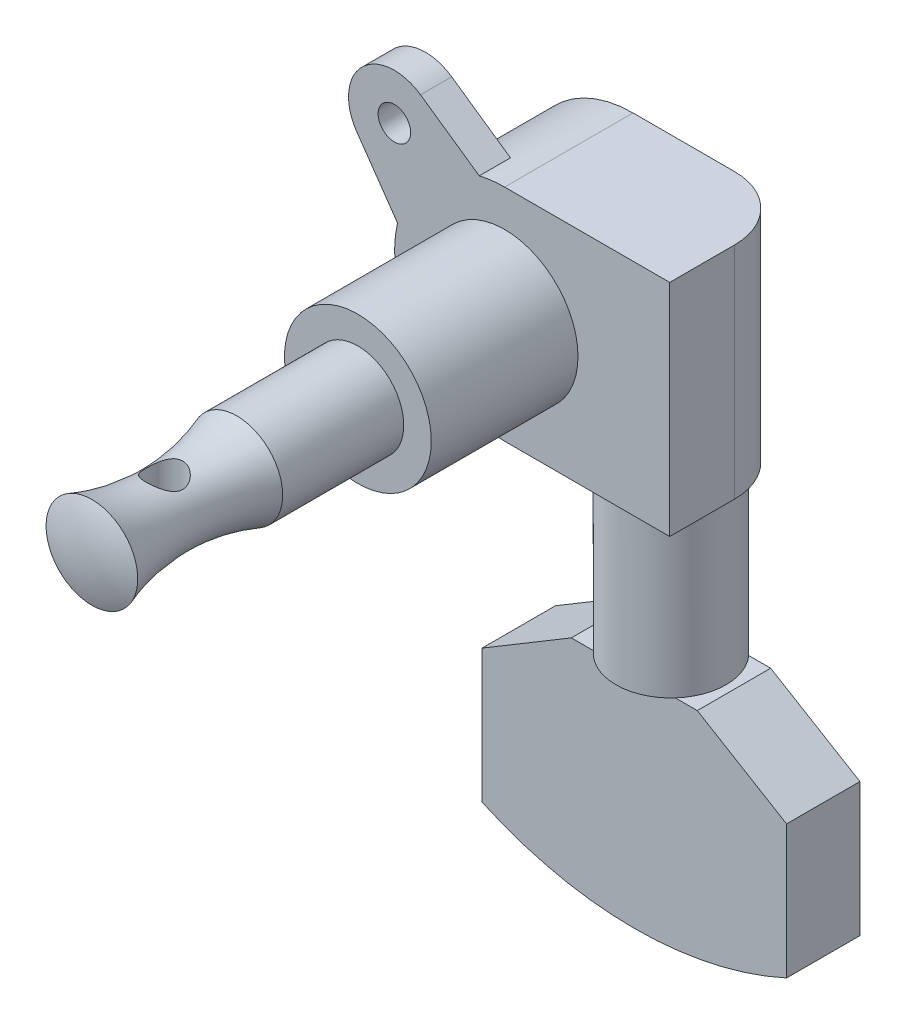
ISO-10303-21;
HEADER;
FILE_DESCRIPTION(('STEP AP214'),'2;1');
FILE_NAME('part.step','',(''),(''),'','','');
FILE_SCHEMA(('AUTOMOTIVE_DESIGN { 1 0 10303 214 1 1 1 1 }'));
ENDSEC;
DATA;
#1=APPLICATION_CONTEXT('core data for automotive mechanical design processes');
#2=APPLICATION_PROTOCOL_DEFINITION('international standard','automotive_design',2000,#1);
#3=PRODUCT_CONTEXT('',#1,'mechanical');
#4=PRODUCT('Part','Part','',(#3));
#5=PRODUCT_RELATED_PRODUCT_CATEGORY('part','',(#4));
#6=PRODUCT_DEFINITION_FORMATION('','',#4);
#7=PRODUCT_DEFINITION_CONTEXT('part definition',#1,'design');
#8=PRODUCT_DEFINITION('design','',#6,#7);
#9=PRODUCT_DEFINITION_SHAPE('','',#8);
#10=(LENGTH_UNIT() NAMED_UNIT(*) SI_UNIT(.MILLI.,.METRE.));
#11=(NAMED_UNIT(*) PLANE_ANGLE_UNIT() SI_UNIT($,.RADIAN.));
#12=(NAMED_UNIT(*) SI_UNIT($,.STERADIAN.) SOLID_ANGLE_UNIT());
#13=UNCERTAINTY_MEASURE_WITH_UNIT(LENGTH_MEASURE(1.E-05),#10,'distance_accuracy_value','');
#14=(GEOMETRIC_REPRESENTATION_CONTEXT(3) GLOBAL_UNCERTAINTY_ASSIGNED_CONTEXT((#13)) GLOBAL_UNIT_ASSIGNED_CONTEXT((#10,
#11,#12)) REPRESENTATION_CONTEXT('',''));
#15=CARTESIAN_POINT('',(0.,0.,0.));
#16=DIRECTION('',(0.,0.,1.));
#17=DIRECTION('',(1.,0.,0.));
#18=AXIS2_PLACEMENT_3D('',#15,#16,#17);
#19=CARTESIAN_POINT('',(7.03,-8.94661103641939,6.94));
#20=DIRECTION('',(0.,0.,-1.));
#21=DIRECTION('',(-1.,0.,0.));
#22=AXIS2_PLACEMENT_3D('',#19,#20,#21);
#23=CYLINDRICAL_SURFACE('',#22,25.3433889635806);
#24=CARTESIAN_POINT('',(7.03,-8.94661103641939,6.94));
#25=DIRECTION('',(0.,0.,-1.));
#26=DIRECTION('',(-1.,0.,0.));
#27=AXIS2_PLACEMENT_3D('',#24,#25,#26);
#28=CIRCLE('',#27,25.3433889635806);
#29=CARTESIAN_POINT('',(-3.511,-31.9938382700659,6.94));
#30=VERTEX_POINT('',#29);
#31=CARTESIAN_POINT('',(17.571,-31.9938382700659,6.94));
#32=VERTEX_POINT('',#31);
#33=EDGE_CURVE('E139',#30,#32,#28,.F.);
#34=ORIENTED_EDGE('',*,*,#33,.F.);
#35=DIRECTION('',(0.,0.,1.));
#36=VECTOR('',#35,1.);
#37=CARTESIAN_POINT('',(-3.511,-31.9938382700659,6.94));
#38=LINE('',#37,#36);
#39=CARTESIAN_POINT('',(-3.511,-31.9938382700659,1.86));
#40=VERTEX_POINT('',#39);
#41=EDGE_CURVE('E136',#40,#30,#38,.T.);
#42=ORIENTED_EDGE('',*,*,#41,.F.);
#43=CARTESIAN_POINT('',(7.03,-8.94661103641939,1.86));
#44=DIRECTION('',(0.,0.,-1.));
#45=DIRECTION('',(-1.,0.,0.));
#46=AXIS2_PLACEMENT_3D('',#43,#44,#45);
#47=CIRCLE('',#46,25.3433889635806);
#48=CARTESIAN_POINT('',(17.571,-31.9938382700659,1.86));
#49=VERTEX_POINT('',#48);
#50=EDGE_CURVE('E19',#49,#40,#47,.T.);
#51=ORIENTED_EDGE('',*,*,#50,.F.);
#52=DIRECTION('',(0.,0.,-1.));
#53=VECTOR('',#52,1.);
#54=CARTESIAN_POINT('',(17.571,-31.9938382700659,1.86));
#55=LINE('',#54,#53);
#56=EDGE_CURVE('E145',#32,#49,#55,.T.);
#57=ORIENTED_EDGE('',*,*,#56,.F.);
#58=EDGE_LOOP('',(#34,#42,#51,#57));
#59=FACE_BOUND('',#58,.T.);
#60=ADVANCED_FACE('F16',(#59),#23,.T.);
#61=CARTESIAN_POINT('',(17.571,-19.05,1.86));
#62=DIRECTION('',(1.,0.,0.));
#63=DIRECTION('',(0.,0.,-1.));
#64=AXIS2_PLACEMENT_3D('',#61,#62,#63);
#65=PLANE('',#64);
#66=DIRECTION('',(0.,0.,1.));
#67=VECTOR('',#66,1.);
#68=CARTESIAN_POINT('',(17.571,-22.7538524438819,6.94));
#69=LINE('',#68,#67);
#70=CARTESIAN_POINT('',(17.571,-22.7538524438819,6.94));
#71=VERTEX_POINT('',#70);
#72=CARTESIAN_POINT('',(17.571,-22.7538524438819,1.86));
#73=VERTEX_POINT('',#72);
#74=EDGE_CURVE('E144',#71,#73,#69,.F.);
#75=ORIENTED_EDGE('',*,*,#74,.F.);
#76=DIRECTION('',(0.,1.,0.));
#77=VECTOR('',#76,1.);
#78=CARTESIAN_POINT('',(17.571,-19.05,6.94));
#79=LINE('',#78,#77);
#80=EDGE_CURVE('E450',#32,#71,#79,.T.);
#81=ORIENTED_EDGE('',*,*,#80,.F.);
#82=ORIENTED_EDGE('',*,*,#56,.T.);
#83=DIRECTION('',(0.,1.,0.));
#84=VECTOR('',#83,1.);
#85=CARTESIAN_POINT('',(17.571,-19.05,1.86));
#86=LINE('',#85,#84);
#87=EDGE_CURVE('E161',#73,#49,#86,.F.);
#88=ORIENTED_EDGE('',*,*,#87,.F.);
#89=EDGE_LOOP('',(#75,#81,#82,#88));
#90=FACE_BOUND('',#89,.T.);
#91=ADVANCED_FACE('F338',(#90),#65,.T.);
#92=CARTESIAN_POINT('',(-3.511,-19.05,6.94));
#93=DIRECTION('',(-1.,0.,0.));
#94=DIRECTION('',(0.,0.,1.));
#95=AXIS2_PLACEMENT_3D('',#92,#93,#94);
#96=PLANE('',#95);
#97=DIRECTION('',(0.,0.,1.));
#98=VECTOR('',#97,1.);
#99=CARTESIAN_POINT('',(-3.511,-22.7538524438819,6.94));
#100=LINE('',#99,#98);
#101=CARTESIAN_POINT('',(-3.511,-22.7538524438819,1.86));
#102=VERTEX_POINT('',#101);
#103=CARTESIAN_POINT('',(-3.511,-22.7538524438819,6.94));
#104=VERTEX_POINT('',#103);
#105=EDGE_CURVE('E150',#102,#104,#100,.T.);
#106=ORIENTED_EDGE('',*,*,#105,.F.);
#107=DIRECTION('',(0.,1.,0.));
#108=VECTOR('',#107,1.);
#109=CARTESIAN_POINT('',(-3.511,-19.05,1.86));
#110=LINE('',#109,#108);
#111=EDGE_CURVE('E148',#40,#102,#110,.T.);
#112=ORIENTED_EDGE('',*,*,#111,.F.);
#113=ORIENTED_EDGE('',*,*,#41,.T.);
#114=DIRECTION('',(0.,1.,0.));
#115=VECTOR('',#114,1.);
#116=CARTESIAN_POINT('',(-3.511,-19.05,6.94));
#117=LINE('',#116,#115);
#118=EDGE_CURVE('E318',#104,#30,#117,.F.);
#119=ORIENTED_EDGE('',*,*,#118,.F.);
#120=EDGE_LOOP('',(#106,#112,#113,#119));
#121=FACE_BOUND('',#120,.T.);
#122=ADVANCED_FACE('F149',(#121),#96,.T.);
#123=CARTESIAN_POINT('',(11.3893157644832,-19.05,6.94));
#124=DIRECTION('',(0.513969357533937,0.857808544790824,0.));
#125=DIRECTION('',(-0.857808544790824,0.513969357533937,0.));
#126=AXIS2_PLACEMENT_3D('',#123,#124,#125);
#127=PLANE('',#126);
#128=DIRECTION('',(-0.857808544790822,0.513969357533941,0.));
#129=VECTOR('',#128,1.);
#130=CARTESIAN_POINT('',(17.571,-22.7538524438819,6.94));
#131=LINE('',#130,#129);
#132=CARTESIAN_POINT('',(11.3893157644832,-19.05,6.94));
#133=VERTEX_POINT('',#132);
#134=EDGE_CURVE('E427',#71,#133,#131,.T.);
#135=ORIENTED_EDGE('',*,*,#134,.F.);
#136=ORIENTED_EDGE('',*,*,#74,.T.);
#137=DIRECTION('',(0.857808544790822,-0.513969357533941,0.));
#138=VECTOR('',#137,1.);
#139=CARTESIAN_POINT('',(11.3893157644832,-19.05,1.86));
#140=LINE('',#139,#138);
#141=CARTESIAN_POINT('',(11.3893157644832,-19.05,1.86));
#142=VERTEX_POINT('',#141);
#143=EDGE_CURVE('E437',#142,#73,#140,.T.);
#144=ORIENTED_EDGE('',*,*,#143,.F.);
#145=DIRECTION('',(0.,0.,1.));
#146=VECTOR('',#145,1.);
#147=CARTESIAN_POINT('',(11.3893157644832,-19.05,4.4));
#148=LINE('',#147,#146);
#149=EDGE_CURVE('E313',#133,#142,#148,.F.);
#150=ORIENTED_EDGE('',*,*,#149,.F.);
#151=EDGE_LOOP('',(#135,#136,#144,#150));
#152=FACE_BOUND('',#151,.T.);
#153=ADVANCED_FACE('F334',(#152),#127,.T.);
#154=CARTESIAN_POINT('',(-3.511,-19.05,1.86));
#155=DIRECTION('',(0.,0.,-1.));
#156=DIRECTION('',(-1.,0.,0.));
#157=AXIS2_PLACEMENT_3D('',#154,#155,#156);
#158=PLANE('',#157);
#159=ORIENTED_EDGE('',*,*,#143,.T.);
#160=ORIENTED_EDGE('',*,*,#87,.T.);
#161=ORIENTED_EDGE('',*,*,#50,.T.);
#162=ORIENTED_EDGE('',*,*,#111,.T.);
#163=DIRECTION('',(-0.857808544790824,-0.513969357533937,0.));
#164=VECTOR('',#163,1.);
#165=CARTESIAN_POINT('',(-3.511,-22.7538524438819,1.86));
#166=LINE('',#165,#164);
#167=CARTESIAN_POINT('',(2.67068423551685,-19.05,1.86));
#168=VERTEX_POINT('',#167);
#169=EDGE_CURVE('E435',#168,#102,#166,.T.);
#170=ORIENTED_EDGE('',*,*,#169,.F.);
#171=DIRECTION('',(-1.,0.,0.));
#172=VECTOR('',#171,1.);
#173=CARTESIAN_POINT('',(-3.511,-19.05,1.86));
#174=LINE('',#173,#172);
#175=CARTESIAN_POINT('',(4.19019366857527,-19.05,1.86));
#176=VERTEX_POINT('',#175);
#177=EDGE_CURVE('E155',#168,#176,#174,.F.);
#178=ORIENTED_EDGE('',*,*,#177,.T.);
#179=DIRECTION('',(1.,0.,0.));
#180=VECTOR('',#179,1.);
#181=CARTESIAN_POINT('',(7.03,-19.05,1.86));
#182=LINE('',#181,#180);
#183=CARTESIAN_POINT('',(9.86980633142473,-19.05,1.86));
#184=VERTEX_POINT('',#183);
#185=EDGE_CURVE('E301',#176,#184,#182,.T.);
#186=ORIENTED_EDGE('',*,*,#185,.T.);
#187=DIRECTION('',(1.,0.,0.));
#188=VECTOR('',#187,1.);
#189=CARTESIAN_POINT('',(7.03,-19.05,1.86));
#190=LINE('',#189,#188);
#191=EDGE_CURVE('E307',#142,#184,#190,.F.);
#192=ORIENTED_EDGE('',*,*,#191,.F.);
#193=EDGE_LOOP('',(#159,#160,#161,#162,#170,#178,#186,#192));
#194=FACE_BOUND('',#193,.T.);
#195=ADVANCED_FACE('F159',(#194),#158,.T.);
#196=CARTESIAN_POINT('',(-3.511,-22.7538524438819,6.94));
#197=DIRECTION('',(-0.513969357533937,0.857808544790824,0.));
#198=DIRECTION('',(-0.857808544790824,-0.513969357533937,0.));
#199=AXIS2_PLACEMENT_3D('',#196,#197,#198);
#200=PLANE('',#199);
#201=DIRECTION('',(-0.857808544790823,-0.513969357533939,0.));
#202=VECTOR('',#201,1.);
#203=CARTESIAN_POINT('',(2.67068423551684,-19.05,6.94));
#204=LINE('',#203,#202);
#205=CARTESIAN_POINT('',(2.67068423551685,-19.05,6.94));
#206=VERTEX_POINT('',#205);
#207=EDGE_CURVE('E449',#206,#104,#204,.T.);
#208=ORIENTED_EDGE('',*,*,#207,.F.);
#209=DIRECTION('',(0.,0.,1.));
#210=VECTOR('',#209,1.);
#211=CARTESIAN_POINT('',(2.67068423551685,-19.05,4.4));
#212=LINE('',#211,#210);
#213=EDGE_CURVE('E298',#168,#206,#212,.T.);
#214=ORIENTED_EDGE('',*,*,#213,.F.);
#215=ORIENTED_EDGE('',*,*,#169,.T.);
#216=ORIENTED_EDGE('',*,*,#105,.T.);
#217=EDGE_LOOP('',(#208,#214,#215,#216));
#218=FACE_BOUND('',#217,.T.);
#219=ADVANCED_FACE('F327',(#218),#200,.T.);
#220=CARTESIAN_POINT('',(17.571,-19.05,6.94));
#221=DIRECTION('',(0.,0.,1.));
#222=DIRECTION('',(1.,0.,0.));
#223=AXIS2_PLACEMENT_3D('',#220,#221,#222);
#224=PLANE('',#223);
#225=ORIENTED_EDGE('',*,*,#207,.T.);
#226=ORIENTED_EDGE('',*,*,#118,.T.);
#227=ORIENTED_EDGE('',*,*,#33,.T.);
#228=ORIENTED_EDGE('',*,*,#80,.T.);
#229=ORIENTED_EDGE('',*,*,#134,.T.);
#230=DIRECTION('',(1.,0.,0.));
#231=VECTOR('',#230,1.);
#232=CARTESIAN_POINT('',(7.03,-19.05,6.94));
#233=LINE('',#232,#231);
#234=CARTESIAN_POINT('',(9.86980633142473,-19.05,6.94));
#235=VERTEX_POINT('',#234);
#236=EDGE_CURVE('E304',#235,#133,#233,.T.);
#237=ORIENTED_EDGE('',*,*,#236,.F.);
#238=DIRECTION('',(1.,0.,0.));
#239=VECTOR('',#238,1.);
#240=CARTESIAN_POINT('',(7.03,-19.05,6.94));
#241=LINE('',#240,#239);
#242=CARTESIAN_POINT('',(4.19019366857527,-19.05,6.94));
#243=VERTEX_POINT('',#242);
#244=EDGE_CURVE('E290',#235,#243,#241,.F.);
#245=ORIENTED_EDGE('',*,*,#244,.T.);
#246=DIRECTION('',(1.,0.,0.));
#247=VECTOR('',#246,1.);
#248=CARTESIAN_POINT('',(7.03,-19.05,6.94));
#249=LINE('',#248,#247);
#250=EDGE_CURVE('E294',#206,#243,#249,.T.);
#251=ORIENTED_EDGE('',*,*,#250,.F.);
#252=EDGE_LOOP('',(#225,#226,#227,#228,#229,#237,#245,#251));
#253=FACE_BOUND('',#252,.T.);
#254=ADVANCED_FACE('F323',(#253),#224,.T.);
#255=CARTESIAN_POINT('',(0.,0.,29.845));
#256=DIRECTION('',(1.,0.,0.));
#257=DIRECTION('',(0.,1.,0.));
#258=AXIS2_PLACEMENT_3D('',#255,#256,#257);
#259=SPHERICAL_SURFACE('',#258,8.25499999999996);
#260=CARTESIAN_POINT('',(0.,0.,37.465));
#261=DIRECTION('',(0.,0.,-1.));
#262=DIRECTION('',(-1.,0.,0.));
#263=AXIS2_PLACEMENT_3D('',#260,#261,#262);
#264=CIRCLE('',#263,3.175);
#265=CARTESIAN_POINT('',(-3.175,0.,37.465));
#266=VERTEX_POINT('',#265);
#267=EDGE_CURVE('E293',#266,#266,#264,.F.);
#268=ORIENTED_EDGE('',*,*,#267,.T.);
#269=EDGE_LOOP('',(#268));
#270=FACE_BOUND('',#269,.T.);
#271=ADVANCED_FACE('F320',(#270),#259,.T.);
#272=CARTESIAN_POINT('',(0.,0.,32.4485));
#273=DIRECTION('',(0.,1.,0.));
#274=DIRECTION('',(0.,0.,1.));
#275=AXIS2_PLACEMENT_3D('',#272,#273,#274);
#276=CYLINDRICAL_SURFACE('',#275,1.27);
#277=CARTESIAN_POINT('',(0.,-2.34134804982679,31.1785));
#278=CARTESIAN_POINT('',(0.0645155415284043,-2.3413432961982,31.1785050060415));
#279=CARTESIAN_POINT('',(0.129120718154893,-2.33821776241501,31.183450840019));
#280=CARTESIAN_POINT('',(0.25635007826998,-2.326022860233,31.2029690807942));
#281=CARTESIAN_POINT('',(0.318969728246022,-2.31694079075164,31.2175620586653));
#282=CARTESIAN_POINT('',(0.440120293002742,-2.29378258410033,31.2555191221188));
#283=CARTESIAN_POINT('',(0.498670535223999,-2.27973230578129,31.2788378274002));
#284=CARTESIAN_POINT('',(0.610832517780306,-2.24784751368233,31.3332982873781));
#285=CARTESIAN_POINT('',(0.664444949383017,-2.23001353075961,31.3644389447602));
#286=CARTESIAN_POINT('',(0.770183759520476,-2.19034853035571,31.4365013773126));
#287=CARTESIAN_POINT('',(0.821826235178395,-2.16830950989919,31.4780165209102));
#288=CARTESIAN_POINT('',(0.917886385020524,-2.12318299543908,31.568307922975));
#289=CARTESIAN_POINT('',(0.962294347095998,-2.10009414436777,31.6170937767228));
#290=CARTESIAN_POINT('',(1.04862298745138,-2.05182788275068,31.7281687326515));
#291=CARTESIAN_POINT('',(1.08942672047412,-2.02678128371553,31.7913908160459));
#292=CARTESIAN_POINT('',(1.15967965765399,-1.98115067695329,31.9253038963243));
#293=CARTESIAN_POINT('',(1.1891481291054,-1.96055912300006,31.9959819568061));
#294=CARTESIAN_POINT('',(1.22935594940783,-1.93155320825814,32.1246053914684));
#295=CARTESIAN_POINT('',(1.24294539262395,-1.92137704348119,32.1812608524178));
#296=CARTESIAN_POINT('',(1.26223319098596,-1.90677986492481,32.2965968233442));
#297=CARTESIAN_POINT('',(1.26794170353594,-1.90235144355943,32.3552746265855));
#298=CARTESIAN_POINT('',(1.27113181491214,-1.89988823379398,32.4731273770166));
#299=CARTESIAN_POINT('',(1.26859456671673,-1.90186809251409,32.5323031543294));
#300=CARTESIAN_POINT('',(1.25541872710925,-1.91195158446425,32.6492261052392));
#301=CARTESIAN_POINT('',(1.24477417326541,-1.92005972464022,32.7069721951007));
#302=CARTESIAN_POINT('',(1.21624965653477,-1.9410862048996,32.8184883981703));
#303=CARTESIAN_POINT('',(1.19850936876097,-1.95391132303948,32.8723128232904));
#304=CARTESIAN_POINT('',(1.15648150650644,-1.98300311405889,32.9763268038985));
#305=CARTESIAN_POINT('',(1.13219163544481,-1.9992709936954,33.0265150765402));
#306=CARTESIAN_POINT('',(1.07282579922777,-2.03692547544775,33.1312759277066));
#307=CARTESIAN_POINT('',(1.03660218576776,-2.05870858387203,33.1850553073578));
#308=CARTESIAN_POINT('',(0.956603541671164,-2.10308888591938,33.2863432882935));
#309=CARTESIAN_POINT('',(0.912820786780159,-2.12568689336888,33.3338453866594));
#310=CARTESIAN_POINT('',(0.810797951449898,-2.17333397788741,33.4288558551749));
#311=CARTESIAN_POINT('',(0.751366940584441,-2.19820861330459,33.4751871420684));
#312=CARTESIAN_POINT('',(0.624111194516701,-2.24390052515201,33.5571488755366));
#313=CARTESIAN_POINT('',(0.55629006378426,-2.26471953408618,33.5927838949333));
#314=CARTESIAN_POINT('',(0.417764775652685,-2.29887962312592,33.650028490796));
#315=CARTESIAN_POINT('',(0.347425169497777,-2.31256942568483,33.6723024769138));
#316=CARTESIAN_POINT('',(0.202962740942721,-2.33242543939802,33.7043493538945));
#317=CARTESIAN_POINT('',(0.128845527349749,-2.33860248452482,33.7141402473216));
#318=CARTESIAN_POINT('',(-0.00899437461165927,-2.34232730514032,33.7200543204683));
#319=CARTESIAN_POINT('',(-0.0726152720470022,-2.3410266563161,33.7180012951376));
#320=CARTESIAN_POINT('',(-0.198445401587482,-2.33255245229131,33.7044939258685));
#321=CARTESIAN_POINT('',(-0.260654665699185,-2.32537903038366,33.6930397953046));
#322=CARTESIAN_POINT('',(-0.379765209659764,-2.30620135250195,33.6618997524301));
#323=CARTESIAN_POINT('',(-0.436776187711693,-2.2943756692098,33.6425171797588));
#324=CARTESIAN_POINT('',(-0.546702043090119,-2.26687564454281,33.5963561239407));
#325=CARTESIAN_POINT('',(-0.599616168872457,-2.2512005992143,33.5695762879044));
#326=CARTESIAN_POINT('',(-0.70601457603287,-2.21529226422759,33.5061776527428));
#327=CARTESIAN_POINT('',(-0.75894661770017,-2.19474988424211,33.4688098698055));
#328=CARTESIAN_POINT('',(-0.858190516112198,-2.15195297967678,33.3868803824016));
#329=CARTESIAN_POINT('',(-0.904494547575605,-2.12969647823013,33.3423103046061));
#330=CARTESIAN_POINT('',(-0.996041306155078,-2.08202527387771,33.2398155192849));
#331=CARTESIAN_POINT('',(-1.04017542644016,-2.05661631229116,33.1808921122809));
#332=CARTESIAN_POINT('',(-1.11802136480856,-2.00876935926069,33.0554310858823));
#333=CARTESIAN_POINT('',(-1.15174246009807,-1.98632873350795,32.9889003169123));
#334=CARTESIAN_POINT('',(-1.20145846810688,-1.95183110936972,32.8642921525223));
#335=CARTESIAN_POINT('',(-1.21970148746193,-1.9385799447173,32.8074464929718));
#336=CARTESIAN_POINT('',(-1.24810624675337,-1.91755363772971,32.6908230098901));
#337=CARTESIAN_POINT('',(-1.25827962516736,-1.90977061080659,32.6310495416919));
#338=CARTESIAN_POINT('',(-1.26998255259826,-1.90079253479882,32.5098570220464));
#339=CARTESIAN_POINT('',(-1.27147070246057,-1.89962903914301,32.4484314889879));
#340=CARTESIAN_POINT('',(-1.2655824650228,-1.90417013375876,32.3262524162664));
#341=CARTESIAN_POINT('',(-1.25820255885927,-1.90987745038486,32.2654991530177));
#342=CARTESIAN_POINT('',(-1.23584197119719,-1.92668000444917,32.1505049469001));
#343=CARTESIAN_POINT('',(-1.2213981233268,-1.93739260392981,32.0960993730753));
#344=CARTESIAN_POINT('',(-1.18585262286941,-1.96277621293754,31.990503287669));
#345=CARTESIAN_POINT('',(-1.16474844365195,-1.9774487243709,31.939314005055));
#346=CARTESIAN_POINT('',(-1.11303754413028,-2.01169397103082,31.8336961666146));
#347=CARTESIAN_POINT('',(-1.08150260993314,-2.03166758409672,31.7798541649505));
#348=CARTESIAN_POINT('',(-1.01125365151988,-2.07314336463508,31.6777114881983));
#349=CARTESIAN_POINT('',(-0.97253369085038,-2.0946467869499,31.6294154491341));
#350=CARTESIAN_POINT('',(-0.880625008861319,-2.14146861788311,31.5304797984215));
#351=CARTESIAN_POINT('',(-0.826084692710484,-2.16675463591504,31.4810678281839));
#352=CARTESIAN_POINT('',(-0.708464277135598,-2.2145215466491,31.3918868501254));
#353=CARTESIAN_POINT('',(-0.645379307892076,-2.23700082557413,31.3521233775734));
#354=CARTESIAN_POINT('',(-0.51218781392149,-2.27659730993986,31.2839832374478));
#355=CARTESIAN_POINT('',(-0.442128292577023,-2.29374757553794,31.2555360440539));
#356=CARTESIAN_POINT('',(-0.333320883848156,-2.31398343741828,31.2224337016774));
#357=CARTESIAN_POINT('',(-0.296471855284281,-2.31981062078107,31.2129991308918));
#358=CARTESIAN_POINT('',(-0.221834206952216,-2.32946631855459,31.1974452528892));
#359=CARTESIAN_POINT('',(-0.184046357383799,-2.33329641809516,31.1913233162146));
#360=CARTESIAN_POINT('',(-0.121807293858874,-2.33781280518529,31.1841201063924));
#361=CARTESIAN_POINT('',(-0.0975146239754468,-2.3391361255162,31.1820149041601));
#362=CARTESIAN_POINT('',(-0.0488189202557583,-2.34090467698216,31.17920385646));
#363=CARTESIAN_POINT('',(-0.0244158790800449,-2.34134984883549,31.1784981054658));
#364=CARTESIAN_POINT('',(0.,-2.34134804982679,31.1785));
#365=B_SPLINE_CURVE_WITH_KNOTS('',3,(#277,#278,#279,#280,#281,#282,#283,#284,#285,#286,#287,
#288,#289,#290,#291,#292,#293,#294,#295,#296,#297,#298,#299,#300,#301,#302,#303,#304,#305,#306,
#307,#308,#309,#310,#311,#312,#313,#314,#315,#316,#317,#318,#319,#320,#321,#322,#323,#324,#325,
#326,#327,#328,#329,#330,#331,#332,#333,#334,#335,#336,#337,#338,#339,#340,#341,#342,#343,#344,
#345,#346,#347,#348,#349,#350,#351,#352,#353,#354,#355,#356,#357,#358,#359,#360,#361,#362,#363,
#364),.UNSPECIFIED.,.T.,.F.,(4,2,2,2,2,2,2,2,2,2,2,2,2,2,2,2,2,2,2,2,2,2,2,2,2,2,2,2,2,2,2,2,2,
2,2,2,2,2,2,2,2,2,2,4),(0.,0.193447265691743,0.387308364686307,0.580174945887285,
0.773014485604155,0.98169604742324,1.19065548940586,1.42741536315655,1.66377100316121,
1.84045973034577,2.01692051749689,2.19378491777056,2.3707795168368,2.54444923192882,
2.71817992286712,2.9226203105629,3.1272708541758,3.3641500562336,3.60092784400602,
3.82466395799369,4.04807704332116,4.23810441872177,4.42812748123644,4.61147458334121,
4.794855240125,4.99798394723869,5.20135053198918,5.43393995378666,5.66632155438781,
5.84904419239942,6.03150281621052,6.2148304445271,6.39823084166319,6.5694619072887,
6.74075800852695,6.93659448249347,7.13259348790329,7.36495654204574,7.59745258756717,
7.828476065292,7.94375097376357,8.05893424615956,8.13213933933659,8.20534937424601),.UNSPECIFIED.);
#366=CARTESIAN_POINT('',(0.,-2.34134804982679,31.1785));
#367=VERTEX_POINT('',#366);
#368=EDGE_CURVE('E257',#367,#367,#365,.T.);
#369=ORIENTED_EDGE('',*,*,#368,.T.);
#370=EDGE_LOOP('',(#369));
#371=FACE_BOUND('',#370,.T.);
#372=CARTESIAN_POINT('',(0.,2.34134804982679,31.1785));
#373=CARTESIAN_POINT('',(-0.0645155415284059,2.3413432961982,31.1785050060415));
#374=CARTESIAN_POINT('',(-0.129120718154894,2.33821776241501,31.183450840019));
#375=CARTESIAN_POINT('',(-0.256350078269981,2.326022860233,31.2029690807942));
#376=CARTESIAN_POINT('',(-0.318969728246023,2.31694079075164,31.2175620586653));
#377=CARTESIAN_POINT('',(-0.440120293002743,2.29378258410033,31.2555191221188));
#378=CARTESIAN_POINT('',(-0.498670535224,2.27973230578129,31.2788378274002));
#379=CARTESIAN_POINT('',(-0.610832517780307,2.24784751368233,31.3332982873781));
#380=CARTESIAN_POINT('',(-0.664444949383019,2.23001353075961,31.3644389447602));
#381=CARTESIAN_POINT('',(-0.770183759520477,2.19034853035571,31.4365013773126));
#382=CARTESIAN_POINT('',(-0.821826235178395,2.16830950989919,31.4780165209102));
#383=CARTESIAN_POINT('',(-0.917886385020525,2.12318299543908,31.568307922975));
#384=CARTESIAN_POINT('',(-0.962294347096,2.10009414436776,31.6170937767228));
#385=CARTESIAN_POINT('',(-1.04862298745138,2.05182788275068,31.7281687326515));
#386=CARTESIAN_POINT('',(-1.08942672047412,2.02678128371552,31.7913908160459));
#387=CARTESIAN_POINT('',(-1.15967965765399,1.98115067695329,31.9253038963243));
#388=CARTESIAN_POINT('',(-1.1891481291054,1.96055912300006,31.9959819568061));
#389=CARTESIAN_POINT('',(-1.22935594940783,1.93155320825814,32.1246053914684));
#390=CARTESIAN_POINT('',(-1.24294539262395,1.92137704348119,32.1812608524178));
#391=CARTESIAN_POINT('',(-1.26223319098596,1.9067798649248,32.2965968233442));
#392=CARTESIAN_POINT('',(-1.26794170353594,1.90235144355943,32.3552746265855));
#393=CARTESIAN_POINT('',(-1.27113181491214,1.89988823379398,32.4731273770166));
#394=CARTESIAN_POINT('',(-1.26859456671673,1.90186809251409,32.5323031543294));
#395=CARTESIAN_POINT('',(-1.25541872710925,1.91195158446425,32.6492261052392));
#396=CARTESIAN_POINT('',(-1.24477417326541,1.92005972464021,32.7069721951007));
#397=CARTESIAN_POINT('',(-1.21624965653478,1.94108620489959,32.8184883981703));
#398=CARTESIAN_POINT('',(-1.19850936876097,1.95391132303948,32.8723128232904));
#399=CARTESIAN_POINT('',(-1.15648150650644,1.98300311405889,32.9763268038985));
#400=CARTESIAN_POINT('',(-1.13219163544481,1.9992709936954,33.0265150765402));
#401=CARTESIAN_POINT('',(-1.07282579922778,2.03692547544774,33.1312759277066));
#402=CARTESIAN_POINT('',(-1.03660218576776,2.05870858387202,33.1850553073578));
#403=CARTESIAN_POINT('',(-0.956603541671168,2.10308888591938,33.2863432882935));
#404=CARTESIAN_POINT('',(-0.912820786780164,2.12568689336888,33.3338453866594));
#405=CARTESIAN_POINT('',(-0.810797951449904,2.1733339778874,33.4288558551749));
#406=CARTESIAN_POINT('',(-0.751366940584448,2.19820861330459,33.4751871420684));
#407=CARTESIAN_POINT('',(-0.624111194516706,2.243900525152,33.5571488755366));
#408=CARTESIAN_POINT('',(-0.556290063784263,2.26471953408618,33.5927838949333));
#409=CARTESIAN_POINT('',(-0.417764775652687,2.29887962312592,33.650028490796));
#410=CARTESIAN_POINT('',(-0.347425169497781,2.31256942568483,33.6723024769138));
#411=CARTESIAN_POINT('',(-0.202962740942728,2.33242543939802,33.7043493538945));
#412=CARTESIAN_POINT('',(-0.128845527349755,2.33860248452482,33.7141402473216));
#413=CARTESIAN_POINT('',(0.00899437461165291,2.34232730514032,33.7200543204683));
#414=CARTESIAN_POINT('',(0.0726152720469959,2.3410266563161,33.7180012951376));
#415=CARTESIAN_POINT('',(0.198445401587475,2.33255245229131,33.7044939258685));
#416=CARTESIAN_POINT('',(0.260654665699179,2.32537903038366,33.6930397953046));
#417=CARTESIAN_POINT('',(0.379765209659759,2.30620135250195,33.6618997524301));
#418=CARTESIAN_POINT('',(0.436776187711689,2.2943756692098,33.6425171797588));
#419=CARTESIAN_POINT('',(0.546702043090116,2.26687564454281,33.5963561239407));
#420=CARTESIAN_POINT('',(0.599616168872453,2.2512005992143,33.5695762879044));
#421=CARTESIAN_POINT('',(0.706014576032868,2.21529226422759,33.5061776527428));
#422=CARTESIAN_POINT('',(0.758946617700171,2.19474988424211,33.4688098698055));
#423=CARTESIAN_POINT('',(0.858190516112197,2.15195297967678,33.3868803824016));
#424=CARTESIAN_POINT('',(0.904494547575603,2.12969647823013,33.3423103046061));
#425=CARTESIAN_POINT('',(0.996041306155073,2.08202527387771,33.2398155192849));
#426=CARTESIAN_POINT('',(1.04017542644016,2.05661631229116,33.1808921122809));
#427=CARTESIAN_POINT('',(1.11802136480856,2.00876935926069,33.0554310858824));
#428=CARTESIAN_POINT('',(1.15174246009807,1.98632873350795,32.9889003169123));
#429=CARTESIAN_POINT('',(1.20145846810688,1.95183110936972,32.8642921525223));
#430=CARTESIAN_POINT('',(1.21970148746193,1.9385799447173,32.8074464929718));
#431=CARTESIAN_POINT('',(1.24810624675337,1.91755363772972,32.6908230098901));
#432=CARTESIAN_POINT('',(1.25827962516736,1.90977061080659,32.6310495416919));
#433=CARTESIAN_POINT('',(1.26998255259826,1.90079253479882,32.5098570220464));
#434=CARTESIAN_POINT('',(1.27147070246057,1.89962903914302,32.448431488988));
#435=CARTESIAN_POINT('',(1.26558246502279,1.90417013375877,32.3262524162664));
#436=CARTESIAN_POINT('',(1.25820255885927,1.90987745038486,32.2654991530177));
#437=CARTESIAN_POINT('',(1.23584197119719,1.92668000444918,32.1505049469001));
#438=CARTESIAN_POINT('',(1.2213981233268,1.93739260392981,32.0960993730753));
#439=CARTESIAN_POINT('',(1.18585262286941,1.96277621293754,31.990503287669));
#440=CARTESIAN_POINT('',(1.16474844365195,1.9774487243709,31.939314005055));
#441=CARTESIAN_POINT('',(1.11303754413028,2.01169397103082,31.8336961666146));
#442=CARTESIAN_POINT('',(1.08150260993314,2.03166758409672,31.7798541649505));
#443=CARTESIAN_POINT('',(1.01125365151989,2.07314336463508,31.6777114881983));
#444=CARTESIAN_POINT('',(0.972533690850382,2.0946467869499,31.6294154491341));
#445=CARTESIAN_POINT('',(0.880625008861321,2.14146861788311,31.5304797984215));
#446=CARTESIAN_POINT('',(0.826084692710489,2.16675463591504,31.4810678281839));
#447=CARTESIAN_POINT('',(0.708464277135603,2.2145215466491,31.3918868501254));
#448=CARTESIAN_POINT('',(0.645379307892077,2.23700082557413,31.3521233775734));
#449=CARTESIAN_POINT('',(0.51218781392149,2.27659730993986,31.2839832374478));
#450=CARTESIAN_POINT('',(0.442128292577024,2.29374757553794,31.2555360440539));
#451=CARTESIAN_POINT('',(0.333320883848158,2.31398343741828,31.2224337016774));
#452=CARTESIAN_POINT('',(0.296471855284283,2.31981062078107,31.2129991308918));
#453=CARTESIAN_POINT('',(0.221834206952219,2.32946631855459,31.1974452528892));
#454=CARTESIAN_POINT('',(0.184046357383802,2.33329641809516,31.1913233162146));
#455=CARTESIAN_POINT('',(0.121807293858876,2.33781280518529,31.1841201063924));
#456=CARTESIAN_POINT('',(0.0975146239754483,2.3391361255162,31.1820149041601));
#457=CARTESIAN_POINT('',(0.0488189202557582,2.34090467698216,31.17920385646));
#458=CARTESIAN_POINT('',(0.0244158790800439,2.34134984883549,31.1784981054658));
#459=CARTESIAN_POINT('',(0.,2.34134804982679,31.1785));
#460=B_SPLINE_CURVE_WITH_KNOTS('',3,(#372,#373,#374,#375,#376,#377,#378,#379,#380,#381,#382,
#383,#384,#385,#386,#387,#388,#389,#390,#391,#392,#393,#394,#395,#396,#397,#398,#399,#400,#401,
#402,#403,#404,#405,#406,#407,#408,#409,#410,#411,#412,#413,#414,#415,#416,#417,#418,#419,#420,
#421,#422,#423,#424,#425,#426,#427,#428,#429,#430,#431,#432,#433,#434,#435,#436,#437,#438,#439,
#440,#441,#442,#443,#444,#445,#446,#447,#448,#449,#450,#451,#452,#453,#454,#455,#456,#457,#458,
#459),.UNSPECIFIED.,.T.,.F.,(4,2,2,2,2,2,2,2,2,2,2,2,2,2,2,2,2,2,2,2,2,2,2,2,2,2,2,2,2,2,2,2,2,
2,2,2,2,2,2,2,2,2,2,4),(0.,0.193447265691742,0.387308364686306,0.580174945887285,
0.773014485604155,0.98169604742324,1.19065548940586,1.42741536315655,1.66377100316121,
1.84045973034577,2.01692051749689,2.19378491777056,2.3707795168368,2.54444923192882,
2.71817992286711,2.92262031056289,3.12727085417579,3.36415005623359,3.60092784400601,
3.82466395799368,4.04807704332115,4.23810441872176,4.42812748123644,4.61147458334121,
4.794855240125,4.99798394723869,5.20135053198917,5.43393995378665,5.6663215543878,
5.84904419239941,6.03150281621051,6.21483044452709,6.39823084166319,6.5694619072887,
6.74075800852693,6.93659448249345,7.13259348790328,7.36495654204573,7.59745258756717,
7.82847606529199,7.94375097376356,8.05893424615956,8.13213933933659,8.20534937424601),.UNSPECIFIED.);
#461=CARTESIAN_POINT('',(0.,2.34134804982679,31.1785));
#462=VERTEX_POINT('',#461);
#463=EDGE_CURVE('E265',#462,#462,#460,.T.);
#464=ORIENTED_EDGE('',*,*,#463,.T.);
#465=EDGE_LOOP('',(#464));
#466=FACE_BOUND('',#465,.T.);
#467=ADVANCED_FACE('F269',(#371,#466),#276,.F.);
#468=CARTESIAN_POINT('',(7.03,-19.05,4.4));
#469=DIRECTION('',(0.,1.,0.));
#470=DIRECTION('',(0.,0.,1.));
#471=AXIS2_PLACEMENT_3D('',#468,#469,#470);
#472=PLANE('',#471);
#473=CARTESIAN_POINT('',(7.03,-19.05,4.4));
#474=DIRECTION('',(0.,-1.,0.));
#475=DIRECTION('',(0.,0.,-1.));
#476=AXIS2_PLACEMENT_3D('',#473,#474,#475);
#477=CIRCLE('',#476,3.81);
#478=EDGE_CURVE('E253',#235,#184,#477,.F.);
#479=ORIENTED_EDGE('',*,*,#478,.F.);
#480=ORIENTED_EDGE('',*,*,#236,.T.);
#481=ORIENTED_EDGE('',*,*,#149,.T.);
#482=ORIENTED_EDGE('',*,*,#191,.T.);
#483=EDGE_LOOP('',(#479,#480,#481,#482));
#484=FACE_BOUND('',#483,.T.);
#485=ADVANCED_FACE('F430',(#484),#472,.T.);
#486=CARTESIAN_POINT('',(7.03,-19.05,4.4));
#487=DIRECTION('',(0.,1.,0.));
#488=DIRECTION('',(0.,0.,1.));
#489=AXIS2_PLACEMENT_3D('',#486,#487,#488);
#490=PLANE('',#489);
#491=CARTESIAN_POINT('',(7.03,-19.05,4.4));
#492=DIRECTION('',(0.,-1.,0.));
#493=DIRECTION('',(0.,0.,-1.));
#494=AXIS2_PLACEMENT_3D('',#491,#492,#493);
#495=CIRCLE('',#494,3.81);
#496=EDGE_CURVE('E249',#184,#176,#495,.F.);
#497=ORIENTED_EDGE('',*,*,#496,.F.);
#498=ORIENTED_EDGE('',*,*,#185,.F.);
#499=EDGE_LOOP('',(#497,#498));
#500=FACE_BOUND('',#499,.T.);
#501=ADVANCED_FACE('F434',(#500),#490,.F.);
#502=CARTESIAN_POINT('',(7.03,-19.05,4.4));
#503=DIRECTION('',(0.,1.,0.));
#504=DIRECTION('',(0.,0.,1.));
#505=AXIS2_PLACEMENT_3D('',#502,#503,#504);
#506=PLANE('',#505);
#507=CARTESIAN_POINT('',(7.03,-19.05,4.4));
#508=DIRECTION('',(0.,-1.,0.));
#509=DIRECTION('',(0.,0.,-1.));
#510=AXIS2_PLACEMENT_3D('',#507,#508,#509);
#511=CIRCLE('',#510,3.81);
#512=EDGE_CURVE('E245',#176,#243,#511,.F.);
#513=ORIENTED_EDGE('',*,*,#512,.F.);
#514=ORIENTED_EDGE('',*,*,#177,.F.);
#515=ORIENTED_EDGE('',*,*,#213,.T.);
#516=ORIENTED_EDGE('',*,*,#250,.T.);
#517=EDGE_LOOP('',(#513,#514,#515,#516));
#518=FACE_BOUND('',#517,.T.);
#519=ADVANCED_FACE('F417',(#518),#506,.T.);
#520=CARTESIAN_POINT('',(7.03,-19.05,4.4));
#521=DIRECTION('',(0.,1.,0.));
#522=DIRECTION('',(0.,0.,1.));
#523=AXIS2_PLACEMENT_3D('',#520,#521,#522);
#524=PLANE('',#523);
#525=CARTESIAN_POINT('',(7.03,-19.05,4.4));
#526=DIRECTION('',(0.,-1.,0.));
#527=DIRECTION('',(0.,0.,-1.));
#528=AXIS2_PLACEMENT_3D('',#525,#526,#527);
#529=CIRCLE('',#528,3.81);
#530=EDGE_CURVE('E241',#243,#235,#529,.F.);
#531=ORIENTED_EDGE('',*,*,#530,.F.);
#532=ORIENTED_EDGE('',*,*,#244,.F.);
#533=EDGE_LOOP('',(#531,#532));
#534=FACE_BOUND('',#533,.T.);
#535=ADVANCED_FACE('F280',(#534),#524,.F.);
#536=CARTESIAN_POINT('',(0.,0.,32.4485));
#537=DIRECTION('',(0.,0.,-1.));
#538=DIRECTION('',(-1.,0.,0.));
#539=AXIS2_PLACEMENT_3D('',#536,#537,#538);
#540=TOROIDAL_SURFACE('',#539,16.8841964285714,14.5981964285714);
#541=CARTESIAN_POINT('',(0.,0.,27.432));
#542=DIRECTION('',(0.,0.,-1.));
#543=DIRECTION('',(-1.,0.,0.));
#544=AXIS2_PLACEMENT_3D('',#541,#542,#543);
#545=CIRCLE('',#544,3.175);
#546=CARTESIAN_POINT('',(-3.175,0.,27.432));
#547=VERTEX_POINT('',#546);
#548=EDGE_CURVE('E240',#547,#547,#545,.T.);
#549=ORIENTED_EDGE('',*,*,#548,.F.);
#550=EDGE_LOOP('',(#549));
#551=FACE_BOUND('',#550,.T.);
#552=ORIENTED_EDGE('',*,*,#368,.F.);
#553=EDGE_LOOP('',(#552));
#554=FACE_BOUND('',#553,.T.);
#555=ORIENTED_EDGE('',*,*,#463,.F.);
#556=EDGE_LOOP('',(#555));
#557=FACE_BOUND('',#556,.T.);
#558=ORIENTED_EDGE('',*,*,#267,.F.);
#559=EDGE_LOOP('',(#558));
#560=FACE_BOUND('',#559,.T.);
#561=ADVANCED_FACE('F273',(#551,#554,#557,#560),#540,.F.);
#562=CARTESIAN_POINT('',(3.88446841913418,0.,0.));
#563=DIRECTION('',(0.,0.,1.));
#564=DIRECTION('',(1.,0.,0.));
#565=AXIS2_PLACEMENT_3D('',#562,#563,#564);
#566=PLANE('',#565);
#567=DIRECTION('',(1.,0.,0.));
#568=VECTOR('',#567,1.);
#569=CARTESIAN_POINT('',(0.,-7.62,0.));
#570=LINE('',#569,#568);
#571=CARTESIAN_POINT('',(0.,-7.62,0.));
#572=VERTEX_POINT('',#571);
#573=CARTESIAN_POINT('',(7.03,-7.62,0.));
#574=VERTEX_POINT('',#573);
#575=EDGE_CURVE('E216',#572,#574,#570,.T.);
#576=ORIENTED_EDGE('',*,*,#575,.F.);
#577=CARTESIAN_POINT('',(0.,0.,0.));
#578=DIRECTION('',(0.,0.,1.));
#579=DIRECTION('',(1.,0.,0.));
#580=AXIS2_PLACEMENT_3D('',#577,#578,#579);
#581=CIRCLE('',#580,7.62);
#582=CARTESIAN_POINT('',(0.,7.62,0.));
#583=VERTEX_POINT('',#582);
#584=EDGE_CURVE('E226',#583,#572,#581,.T.);
#585=ORIENTED_EDGE('',*,*,#584,.F.);
#586=DIRECTION('',(-1.,0.,0.));
#587=VECTOR('',#586,1.);
#588=CARTESIAN_POINT('',(11.43,7.62,0.));
#589=LINE('',#588,#587);
#590=CARTESIAN_POINT('',(7.03,7.62,0.));
#591=VERTEX_POINT('',#590);
#592=EDGE_CURVE('E239',#591,#583,#589,.T.);
#593=ORIENTED_EDGE('',*,*,#592,.F.);
#594=DIRECTION('',(0.,1.,0.));
#595=VECTOR('',#594,1.);
#596=CARTESIAN_POINT('',(7.03,-3.81,0.));
#597=LINE('',#596,#595);
#598=EDGE_CURVE('E244',#574,#591,#597,.T.);
#599=ORIENTED_EDGE('',*,*,#598,.F.);
#600=EDGE_LOOP('',(#576,#585,#593,#599));
#601=FACE_BOUND('',#600,.T.);
#602=ADVANCED_FACE('F279',(#601),#566,.F.);
#603=CARTESIAN_POINT('',(7.03,-7.62,4.4));
#604=DIRECTION('',(0.,-1.,0.));
#605=DIRECTION('',(0.,0.,-1.));
#606=AXIS2_PLACEMENT_3D('',#603,#604,#605);
#607=CYLINDRICAL_SURFACE('',#606,3.81);
#608=CARTESIAN_POINT('',(7.03,-7.62,4.4));
#609=DIRECTION('',(0.,-1.,0.));
#610=DIRECTION('',(0.,0.,-1.));
#611=AXIS2_PLACEMENT_3D('',#608,#609,#610);
#612=CIRCLE('',#611,3.81);
#613=CARTESIAN_POINT('',(7.03,-7.62,0.59));
#614=VERTEX_POINT('',#613);
#615=EDGE_CURVE('E211',#614,#614,#612,.F.);
#616=ORIENTED_EDGE('',*,*,#615,.F.);
#617=EDGE_LOOP('',(#616));
#618=FACE_BOUND('',#617,.T.);
#619=ORIENTED_EDGE('',*,*,#512,.T.);
#620=ORIENTED_EDGE('',*,*,#530,.T.);
#621=ORIENTED_EDGE('',*,*,#478,.T.);
#622=ORIENTED_EDGE('',*,*,#496,.T.);
#623=EDGE_LOOP('',(#619,#620,#621,#622));
#624=FACE_BOUND('',#623,.T.);
#625=ADVANCED_FACE('F403',(#618,#624),#607,.T.);
#626=CARTESIAN_POINT('',(7.03,-3.81,4.4));
#627=DIRECTION('',(0.,1.,0.));
#628=DIRECTION('',(0.,0.,1.));
#629=AXIS2_PLACEMENT_3D('',#626,#627,#628);
#630=CYLINDRICAL_SURFACE('',#629,4.4);
#631=CARTESIAN_POINT('',(7.03,-7.62,4.4));
#632=DIRECTION('',(0.,1.,0.));
#633=DIRECTION('',(0.,0.,1.));
#634=AXIS2_PLACEMENT_3D('',#631,#632,#633);
#635=CIRCLE('',#634,4.4);
#636=CARTESIAN_POINT('',(11.43,-7.62,4.4));
#637=VERTEX_POINT('',#636);
#638=EDGE_CURVE('E217',#574,#637,#635,.F.);
#639=ORIENTED_EDGE('',*,*,#638,.F.);
#640=ORIENTED_EDGE('',*,*,#598,.T.);
#641=CARTESIAN_POINT('',(7.03,7.62,4.4));
#642=DIRECTION('',(0.,1.,0.));
#643=DIRECTION('',(0.,0.,1.));
#644=AXIS2_PLACEMENT_3D('',#641,#642,#643);
#645=CIRCLE('',#644,4.4);
#646=CARTESIAN_POINT('',(11.43,7.62,4.4));
#647=VERTEX_POINT('',#646);
#648=EDGE_CURVE('E235',#647,#591,#645,.T.);
#649=ORIENTED_EDGE('',*,*,#648,.F.);
#650=DIRECTION('',(0.,1.,0.));
#651=VECTOR('',#650,1.);
#652=CARTESIAN_POINT('',(11.43,-7.62,4.4));
#653=LINE('',#652,#651);
#654=EDGE_CURVE('E215',#637,#647,#653,.T.);
#655=ORIENTED_EDGE('',*,*,#654,.F.);
#656=EDGE_LOOP('',(#639,#640,#649,#655));
#657=FACE_BOUND('',#656,.T.);
#658=ADVANCED_FACE('F400',(#657),#630,.T.);
#659=CARTESIAN_POINT('',(-6.82432551722987,6.82432551722986,6.731));
#660=DIRECTION('',(0.,0.,1.));
#661=DIRECTION('',(1.,0.,0.));
#662=AXIS2_PLACEMENT_3D('',#659,#660,#661);
#663=PLANE('',#662);
#664=CARTESIAN_POINT('',(-7.63321770290878,7.63321770290877,6.731));
#665=DIRECTION('',(0.,0.,-1.));
#666=DIRECTION('',(-1.,0.,0.));
#667=AXIS2_PLACEMENT_3D('',#664,#665,#666);
#668=CIRCLE('',#667,1.125);
#669=CARTESIAN_POINT('',(-8.75821770290878,7.63321770290877,6.731));
#670=VERTEX_POINT('',#669);
#671=EDGE_CURVE('E207',#670,#670,#668,.F.);
#672=ORIENTED_EDGE('',*,*,#671,.T.);
#673=EDGE_LOOP('',(#672));
#674=FACE_BOUND('',#673,.T.);
#675=CARTESIAN_POINT('',(0.,0.,6.731));
#676=DIRECTION('',(0.,0.,1.));
#677=DIRECTION('',(1.,0.,0.));
#678=AXIS2_PLACEMENT_3D('',#675,#676,#677);
#679=CIRCLE('',#678,7.62);
#680=CARTESIAN_POINT('',(-7.41465026579407,1.7570889095205,6.731));
#681=VERTEX_POINT('',#680);
#682=CARTESIAN_POINT('',(-1.75708890952052,7.41465026579406,6.731));
#683=VERTEX_POINT('',#682);
#684=EDGE_CURVE('E221',#681,#683,#679,.F.);
#685=ORIENTED_EDGE('',*,*,#684,.F.);
#686=DIRECTION('',(0.570861218729075,-0.82104656929504,0.));
#687=VECTOR('',#686,1.);
#688=CARTESIAN_POINT('',(-7.41465026579407,1.7570889095205,6.731));
#689=LINE('',#688,#687);
#690=CARTESIAN_POINT('',(-10.2400405604205,5.82073333344395,6.731));
#691=VERTEX_POINT('',#690);
#692=EDGE_CURVE('E488',#691,#681,#689,.T.);
#693=ORIENTED_EDGE('',*,*,#692,.F.);
#694=CARTESIAN_POINT('',(-7.63321770290878,7.63321770290877,6.731));
#695=DIRECTION('',(0.,0.,-1.));
#696=DIRECTION('',(-1.,0.,0.));
#697=AXIS2_PLACEMENT_3D('',#694,#695,#696);
#698=CIRCLE('',#697,3.175);
#699=CARTESIAN_POINT('',(-5.82073333344397,10.2400405604205,6.731));
#700=VERTEX_POINT('',#699);
#701=EDGE_CURVE('E230',#700,#691,#698,.F.);
#702=ORIENTED_EDGE('',*,*,#701,.F.);
#703=DIRECTION('',(-0.82104656929504,0.570861218729075,0.));
#704=VECTOR('',#703,1.);
#705=CARTESIAN_POINT('',(-5.82073333344397,10.2400405604205,6.731));
#706=LINE('',#705,#704);
#707=EDGE_CURVE('E288',#683,#700,#706,.T.);
#708=ORIENTED_EDGE('',*,*,#707,.F.);
#709=EDGE_LOOP('',(#685,#693,#702,#708));
#710=FACE_BOUND('',#709,.T.);
#711=ADVANCED_FACE('F396',(#674,#710),#663,.F.);
#712=CARTESIAN_POINT('',(0.,0.,23.241));
#713=DIRECTION('',(0.,0.,-1.));
#714=DIRECTION('',(-1.,0.,0.));
#715=AXIS2_PLACEMENT_3D('',#712,#713,#714);
#716=CYLINDRICAL_SURFACE('',#715,3.175);
#717=ORIENTED_EDGE('',*,*,#548,.T.);
#718=EDGE_LOOP('',(#717));
#719=FACE_BOUND('',#718,.T.);
#720=CARTESIAN_POINT('',(0.,0.,19.05));
#721=DIRECTION('',(0.,0.,-1.));
#722=DIRECTION('',(-1.,0.,0.));
#723=AXIS2_PLACEMENT_3D('',#720,#721,#722);
#724=CIRCLE('',#723,3.175);
#725=CARTESIAN_POINT('',(-3.175,0.,19.05));
#726=VERTEX_POINT('',#725);
#727=EDGE_CURVE('E203',#726,#726,#724,.T.);
#728=ORIENTED_EDGE('',*,*,#727,.F.);
#729=EDGE_LOOP('',(#728));
#730=FACE_BOUND('',#729,.T.);
#731=ADVANCED_FACE('F392',(#719,#730),#716,.T.);
#732=CARTESIAN_POINT('',(11.43,7.62,0.));
#733=DIRECTION('',(0.,1.,0.));
#734=DIRECTION('',(-1.,0.,0.));
#735=AXIS2_PLACEMENT_3D('',#732,#733,#734);
#736=PLANE('',#735);
#737=DIRECTION('',(1.,0.,0.));
#738=VECTOR('',#737,1.);
#739=CARTESIAN_POINT('',(3.88446841913418,7.62,8.89));
#740=LINE('',#739,#738);
#741=CARTESIAN_POINT('',(11.43,7.62,8.89));
#742=VERTEX_POINT('',#741);
#743=CARTESIAN_POINT('',(0.,7.62,8.89));
#744=VERTEX_POINT('',#743);
#745=EDGE_CURVE('E202',#742,#744,#740,.F.);
#746=ORIENTED_EDGE('',*,*,#745,.F.);
#747=DIRECTION('',(0.,0.,-1.));
#748=VECTOR('',#747,1.);
#749=CARTESIAN_POINT('',(11.43,7.62,0.));
#750=LINE('',#749,#748);
#751=EDGE_CURVE('E491',#647,#742,#750,.F.);
#752=ORIENTED_EDGE('',*,*,#751,.F.);
#753=ORIENTED_EDGE('',*,*,#648,.T.);
#754=ORIENTED_EDGE('',*,*,#592,.T.);
#755=DIRECTION('',(0.,0.,1.));
#756=VECTOR('',#755,1.);
#757=CARTESIAN_POINT('',(0.,7.62,0.));
#758=LINE('',#757,#756);
#759=EDGE_CURVE('E229',#744,#583,#758,.F.);
#760=ORIENTED_EDGE('',*,*,#759,.F.);
#761=EDGE_LOOP('',(#746,#752,#753,#754,#760));
#762=FACE_BOUND('',#761,.T.);
#763=ADVANCED_FACE('F388',(#762),#736,.T.);
#764=CARTESIAN_POINT('',(-5.82073333344397,10.2400405604205,8.89));
#765=DIRECTION('',(0.570861218729075,0.82104656929504,0.));
#766=DIRECTION('',(-0.82104656929504,0.570861218729075,0.));
#767=AXIS2_PLACEMENT_3D('',#764,#765,#766);
#768=PLANE('',#767);
#769=ORIENTED_EDGE('',*,*,#707,.T.);
#770=DIRECTION('',(0.,0.,-1.));
#771=VECTOR('',#770,1.);
#772=CARTESIAN_POINT('',(-5.82073333344396,10.2400405604205,8.89));
#773=LINE('',#772,#771);
#774=CARTESIAN_POINT('',(-5.82073333344397,10.2400405604205,8.89));
#775=VERTEX_POINT('',#774);
#776=EDGE_CURVE('E234',#775,#700,#773,.T.);
#777=ORIENTED_EDGE('',*,*,#776,.F.);
#778=DIRECTION('',(-0.821046569295043,0.570861218729071,0.));
#779=VECTOR('',#778,1.);
#780=CARTESIAN_POINT('',(-1.75708890952051,7.41465026579407,8.89));
#781=LINE('',#780,#779);
#782=CARTESIAN_POINT('',(-1.75708890952051,7.41465026579407,8.89));
#783=VERTEX_POINT('',#782);
#784=EDGE_CURVE('E197',#783,#775,#781,.T.);
#785=ORIENTED_EDGE('',*,*,#784,.F.);
#786=DIRECTION('',(0.,0.,1.));
#787=VECTOR('',#786,1.);
#788=CARTESIAN_POINT('',(-1.75708890952051,7.41465026579407,0.));
#789=LINE('',#788,#787);
#790=EDGE_CURVE('E501',#683,#783,#789,.T.);
#791=ORIENTED_EDGE('',*,*,#790,.F.);
#792=EDGE_LOOP('',(#769,#777,#785,#791));
#793=FACE_BOUND('',#792,.T.);
#794=ADVANCED_FACE('F384',(#793),#768,.T.);
#795=CARTESIAN_POINT('',(-7.63321770290878,7.63321770290877,8.89));
#796=DIRECTION('',(0.,0.,-1.));
#797=DIRECTION('',(-1.,0.,0.));
#798=AXIS2_PLACEMENT_3D('',#795,#796,#797);
#799=CYLINDRICAL_SURFACE('',#798,3.175);
#800=ORIENTED_EDGE('',*,*,#701,.T.);
#801=DIRECTION('',(0.,0.,1.));
#802=VECTOR('',#801,1.);
#803=CARTESIAN_POINT('',(-10.2400405604205,5.82073333344395,8.89));
#804=LINE('',#803,#802);
#805=CARTESIAN_POINT('',(-10.2400405604205,5.82073333344397,8.89));
#806=VERTEX_POINT('',#805);
#807=EDGE_CURVE('E233',#806,#691,#804,.F.);
#808=ORIENTED_EDGE('',*,*,#807,.F.);
#809=CARTESIAN_POINT('',(-7.63321770290878,7.63321770290877,8.89));
#810=DIRECTION('',(0.,0.,-1.));
#811=DIRECTION('',(-1.,0.,0.));
#812=AXIS2_PLACEMENT_3D('',#809,#810,#811);
#813=CIRCLE('',#812,3.175);
#814=EDGE_CURVE('E193',#775,#806,#813,.F.);
#815=ORIENTED_EDGE('',*,*,#814,.F.);
#816=ORIENTED_EDGE('',*,*,#776,.T.);
#817=EDGE_LOOP('',(#800,#808,#815,#816));
#818=FACE_BOUND('',#817,.T.);
#819=ADVANCED_FACE('F380',(#818),#799,.T.);
#820=CARTESIAN_POINT('',(-7.41465026579407,1.7570889095205,8.89));
#821=DIRECTION('',(-0.82104656929504,-0.570861218729075,0.));
#822=DIRECTION('',(0.570861218729075,-0.82104656929504,0.));
#823=AXIS2_PLACEMENT_3D('',#820,#821,#822);
#824=PLANE('',#823);
#825=ORIENTED_EDGE('',*,*,#692,.T.);
#826=DIRECTION('',(0.,0.,1.));
#827=VECTOR('',#826,1.);
#828=CARTESIAN_POINT('',(-7.41465026579407,1.7570889095205,0.));
#829=LINE('',#828,#827);
#830=CARTESIAN_POINT('',(-7.41465026579407,1.7570889095205,8.89));
#831=VERTEX_POINT('',#830);
#832=EDGE_CURVE('E225',#831,#681,#829,.F.);
#833=ORIENTED_EDGE('',*,*,#832,.F.);
#834=DIRECTION('',(0.570861218729071,-0.821046569295043,0.));
#835=VECTOR('',#834,1.);
#836=CARTESIAN_POINT('',(-10.2400405604205,5.82073333344396,8.89));
#837=LINE('',#836,#835);
#838=EDGE_CURVE('E192',#806,#831,#837,.T.);
#839=ORIENTED_EDGE('',*,*,#838,.F.);
#840=ORIENTED_EDGE('',*,*,#807,.T.);
#841=EDGE_LOOP('',(#825,#833,#839,#840));
#842=FACE_BOUND('',#841,.T.);
#843=ADVANCED_FACE('F376',(#842),#824,.T.);
#844=CARTESIAN_POINT('',(0.,0.,0.));
#845=DIRECTION('',(0.,0.,1.));
#846=DIRECTION('',(1.,0.,0.));
#847=AXIS2_PLACEMENT_3D('',#844,#845,#846);
#848=CYLINDRICAL_SURFACE('',#847,7.62);
#849=ORIENTED_EDGE('',*,*,#832,.T.);
#850=ORIENTED_EDGE('',*,*,#684,.T.);
#851=ORIENTED_EDGE('',*,*,#790,.T.);
#852=CARTESIAN_POINT('',(0.,0.,8.89));
#853=DIRECTION('',(0.,0.,1.));
#854=DIRECTION('',(1.,0.,0.));
#855=AXIS2_PLACEMENT_3D('',#852,#853,#854);
#856=CIRCLE('',#855,7.62);
#857=EDGE_CURVE('E198',#744,#783,#856,.T.);
#858=ORIENTED_EDGE('',*,*,#857,.F.);
#859=ORIENTED_EDGE('',*,*,#759,.T.);
#860=ORIENTED_EDGE('',*,*,#584,.T.);
#861=DIRECTION('',(0.,0.,-1.));
#862=VECTOR('',#861,1.);
#863=CARTESIAN_POINT('',(0.,-7.62,0.));
#864=LINE('',#863,#862);
#865=CARTESIAN_POINT('',(0.,-7.62,8.89));
#866=VERTEX_POINT('',#865);
#867=EDGE_CURVE('E220',#866,#572,#864,.T.);
#868=ORIENTED_EDGE('',*,*,#867,.F.);
#869=CARTESIAN_POINT('',(0.,0.,8.89));
#870=DIRECTION('',(0.,0.,1.));
#871=DIRECTION('',(1.,0.,0.));
#872=AXIS2_PLACEMENT_3D('',#869,#870,#871);
#873=CIRCLE('',#872,7.62);
#874=EDGE_CURVE('E187',#831,#866,#873,.T.);
#875=ORIENTED_EDGE('',*,*,#874,.F.);
#876=EDGE_LOOP('',(#849,#850,#851,#858,#859,#860,#868,#875));
#877=FACE_BOUND('',#876,.T.);
#878=ADVANCED_FACE('F372',(#877),#848,.T.);
#879=CARTESIAN_POINT('',(0.,-7.62,0.));
#880=DIRECTION('',(0.,-1.,0.));
#881=DIRECTION('',(0.,0.,-1.));
#882=AXIS2_PLACEMENT_3D('',#879,#880,#881);
#883=PLANE('',#882);
#884=ORIENTED_EDGE('',*,*,#615,.T.);
#885=EDGE_LOOP('',(#884));
#886=FACE_BOUND('',#885,.T.);
#887=ORIENTED_EDGE('',*,*,#867,.T.);
#888=ORIENTED_EDGE('',*,*,#575,.T.);
#889=ORIENTED_EDGE('',*,*,#638,.T.);
#890=DIRECTION('',(0.,0.,-1.));
#891=VECTOR('',#890,1.);
#892=CARTESIAN_POINT('',(11.43,-7.62,0.));
#893=LINE('',#892,#891);
#894=CARTESIAN_POINT('',(11.43,-7.62,8.89));
#895=VERTEX_POINT('',#894);
#896=EDGE_CURVE('E35',#895,#637,#893,.T.);
#897=ORIENTED_EDGE('',*,*,#896,.F.);
#898=DIRECTION('',(1.,0.,0.));
#899=VECTOR('',#898,1.);
#900=CARTESIAN_POINT('',(3.88446841913418,-7.62,8.89));
#901=LINE('',#900,#899);
#902=EDGE_CURVE('E191',#866,#895,#901,.T.);
#903=ORIENTED_EDGE('',*,*,#902,.F.);
#904=EDGE_LOOP('',(#887,#888,#889,#897,#903));
#905=FACE_BOUND('',#904,.T.);
#906=ADVANCED_FACE('F368',(#886,#905),#883,.T.);
#907=CARTESIAN_POINT('',(11.43,-7.62,0.));
#908=DIRECTION('',(1.,0.,0.));
#909=DIRECTION('',(0.,0.,-1.));
#910=AXIS2_PLACEMENT_3D('',#907,#908,#909);
#911=PLANE('',#910);
#912=DIRECTION('',(0.,1.,0.));
#913=VECTOR('',#912,1.);
#914=CARTESIAN_POINT('',(11.43,0.,8.89));
#915=LINE('',#914,#913);
#916=EDGE_CURVE('E186',#895,#742,#915,.T.);
#917=ORIENTED_EDGE('',*,*,#916,.F.);
#918=ORIENTED_EDGE('',*,*,#896,.T.);
#919=ORIENTED_EDGE('',*,*,#654,.T.);
#920=ORIENTED_EDGE('',*,*,#751,.T.);
#921=EDGE_LOOP('',(#917,#918,#919,#920));
#922=FACE_BOUND('',#921,.T.);
#923=ADVANCED_FACE('F364',(#922),#911,.T.);
#924=CARTESIAN_POINT('',(-7.63321770290878,7.63321770290877,8.89));
#925=DIRECTION('',(0.,0.,-1.));
#926=DIRECTION('',(-1.,0.,0.));
#927=AXIS2_PLACEMENT_3D('',#924,#925,#926);
#928=CYLINDRICAL_SURFACE('',#927,1.125);
#929=CARTESIAN_POINT('',(-7.63321770290878,7.63321770290877,8.89));
#930=DIRECTION('',(0.,0.,-1.));
#931=DIRECTION('',(-1.,0.,0.));
#932=AXIS2_PLACEMENT_3D('',#929,#930,#931);
#933=CIRCLE('',#932,1.125);
#934=CARTESIAN_POINT('',(-8.75821770290878,7.63321770290877,8.89));
#935=VERTEX_POINT('',#934);
#936=EDGE_CURVE('E183',#935,#935,#933,.T.);
#937=ORIENTED_EDGE('',*,*,#936,.F.);
#938=EDGE_LOOP('',(#937));
#939=FACE_BOUND('',#938,.T.);
#940=ORIENTED_EDGE('',*,*,#671,.F.);
#941=EDGE_LOOP('',(#940));
#942=FACE_BOUND('',#941,.T.);
#943=ADVANCED_FACE('F360',(#939,#942),#928,.F.);
#944=CARTESIAN_POINT('',(0.,0.,19.05));
#945=DIRECTION('',(0.,0.,1.));
#946=DIRECTION('',(1.,0.,0.));
#947=AXIS2_PLACEMENT_3D('',#944,#945,#946);
#948=PLANE('',#947);
#949=ORIENTED_EDGE('',*,*,#727,.T.);
#950=EDGE_LOOP('',(#949));
#951=FACE_BOUND('',#950,.T.);
#952=CARTESIAN_POINT('',(0.,0.,19.05));
#953=DIRECTION('',(0.,0.,1.));
#954=DIRECTION('',(1.,0.,0.));
#955=AXIS2_PLACEMENT_3D('',#952,#953,#954);
#956=CIRCLE('',#955,5.07999999999999);
#957=CARTESIAN_POINT('',(5.07999999999999,0.,19.05));
#958=VERTEX_POINT('',#957);
#959=EDGE_CURVE('E26',#958,#958,#956,.F.);
#960=ORIENTED_EDGE('',*,*,#959,.F.);
#961=EDGE_LOOP('',(#960));
#962=FACE_BOUND('',#961,.T.);
#963=ADVANCED_FACE('F353',(#951,#962),#948,.T.);
#964=CARTESIAN_POINT('',(3.88446841913418,0.,8.89));
#965=DIRECTION('',(0.,0.,1.));
#966=DIRECTION('',(1.,0.,0.));
#967=AXIS2_PLACEMENT_3D('',#964,#965,#966);
#968=PLANE('',#967);
#969=CARTESIAN_POINT('',(0.,0.,8.89));
#970=DIRECTION('',(0.,0.,1.));
#971=DIRECTION('',(1.,0.,0.));
#972=AXIS2_PLACEMENT_3D('',#969,#970,#971);
#973=CIRCLE('',#972,5.07999999999999);
#974=CARTESIAN_POINT('',(5.07999999999999,0.,8.89));
#975=VERTEX_POINT('',#974);
#976=EDGE_CURVE('E11',#975,#975,#973,.T.);
#977=ORIENTED_EDGE('',*,*,#976,.F.);
#978=EDGE_LOOP('',(#977));
#979=FACE_BOUND('',#978,.T.);
#980=ORIENTED_EDGE('',*,*,#936,.T.);
#981=EDGE_LOOP('',(#980));
#982=FACE_BOUND('',#981,.T.);
#983=ORIENTED_EDGE('',*,*,#902,.T.);
#984=ORIENTED_EDGE('',*,*,#916,.T.);
#985=ORIENTED_EDGE('',*,*,#745,.T.);
#986=ORIENTED_EDGE('',*,*,#857,.T.);
#987=ORIENTED_EDGE('',*,*,#784,.T.);
#988=ORIENTED_EDGE('',*,*,#814,.T.);
#989=ORIENTED_EDGE('',*,*,#838,.T.);
#990=ORIENTED_EDGE('',*,*,#874,.T.);
#991=EDGE_LOOP('',(#983,#984,#985,#986,#987,#988,#989,#990));
#992=FACE_BOUND('',#991,.T.);
#993=ADVANCED_FACE('F347',(#979,#982,#992),#968,.T.);
#994=CARTESIAN_POINT('',(0.,0.,8.89));
#995=DIRECTION('',(0.,0.,1.));
#996=DIRECTION('',(1.,0.,0.));
#997=AXIS2_PLACEMENT_3D('',#994,#995,#996);
#998=CYLINDRICAL_SURFACE('',#997,5.07999999999999);
#999=ORIENTED_EDGE('',*,*,#976,.T.);
#1000=EDGE_LOOP('',(#999));
#1001=FACE_BOUND('',#1000,.T.);
#1002=ORIENTED_EDGE('',*,*,#959,.T.);
#1003=EDGE_LOOP('',(#1002));
#1004=FACE_BOUND('',#1003,.T.);
#1005=ADVANCED_FACE('F345',(#1001,#1004),#998,.T.);
#1006=CLOSED_SHELL('',(#60,#91,#122,#153,#195,#219,#254,#271,#467,#485,#501,#519,#535,#561,#602,
#625,#658,#711,#731,#763,#794,#819,#843,#878,#906,#923,#943,#963,#993,#1005));
#1007=MANIFOLD_SOLID_BREP('B1',#1006);
#1008=ADVANCED_BREP_SHAPE_REPRESENTATION('',(#18,#1007),#14);
#1009=SHAPE_DEFINITION_REPRESENTATION(#9,#1008);
ENDSEC;
END-ISO-10303-21;
